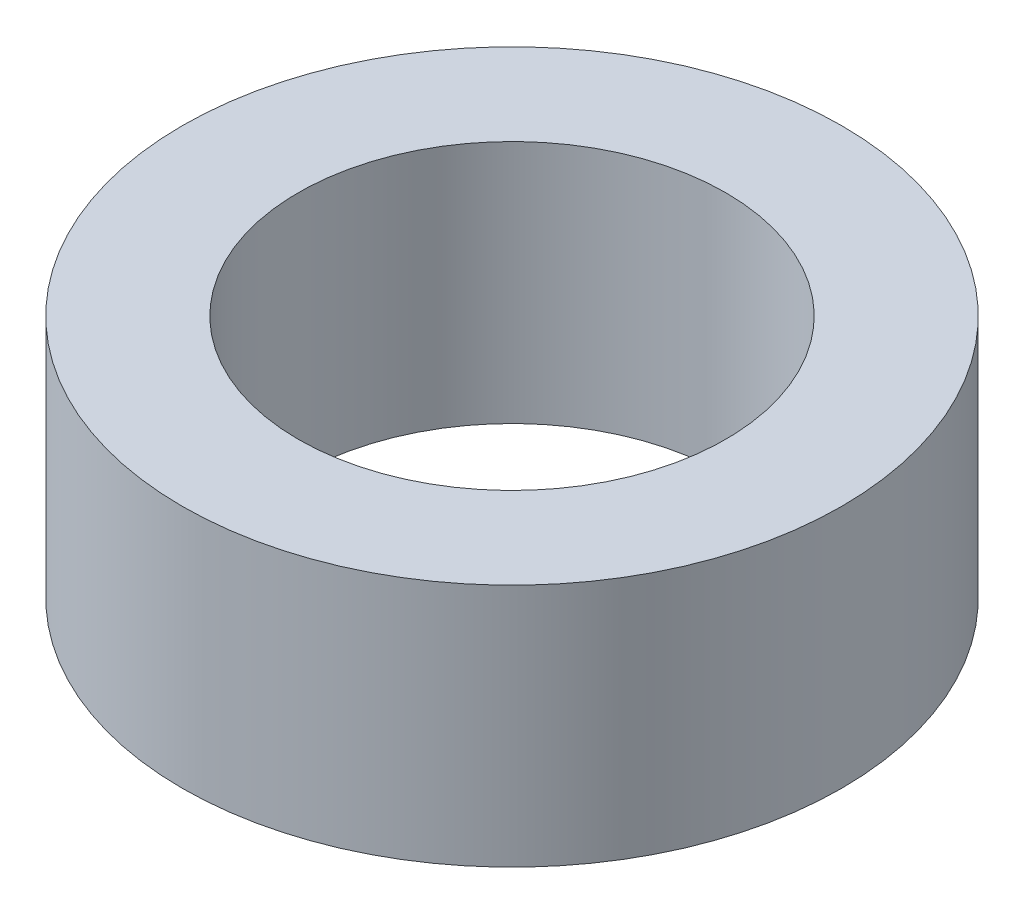
ISO-10303-21;
HEADER;
FILE_DESCRIPTION(('STEP AP214'),'2;1');
FILE_NAME('part.step','',(''),(''),'','','');
FILE_SCHEMA(('AUTOMOTIVE_DESIGN { 1 0 10303 214 1 1 1 1 }'));
ENDSEC;
DATA;
#1=APPLICATION_CONTEXT('core data for automotive mechanical design processes');
#2=APPLICATION_PROTOCOL_DEFINITION('international standard','automotive_design',2000,#1);
#3=PRODUCT_CONTEXT('',#1,'mechanical');
#4=PRODUCT('Part','Part','',(#3));
#5=PRODUCT_RELATED_PRODUCT_CATEGORY('part','',(#4));
#6=PRODUCT_DEFINITION_FORMATION('','',#4);
#7=PRODUCT_DEFINITION_CONTEXT('part definition',#1,'design');
#8=PRODUCT_DEFINITION('design','',#6,#7);
#9=PRODUCT_DEFINITION_SHAPE('','',#8);
#10=(LENGTH_UNIT() NAMED_UNIT(*) SI_UNIT(.MILLI.,.METRE.));
#11=(NAMED_UNIT(*) PLANE_ANGLE_UNIT() SI_UNIT($,.RADIAN.));
#12=(NAMED_UNIT(*) SI_UNIT($,.STERADIAN.) SOLID_ANGLE_UNIT());
#13=UNCERTAINTY_MEASURE_WITH_UNIT(LENGTH_MEASURE(1.E-05),#10,'distance_accuracy_value','');
#14=(GEOMETRIC_REPRESENTATION_CONTEXT(3) GLOBAL_UNCERTAINTY_ASSIGNED_CONTEXT((#13)) GLOBAL_UNIT_ASSIGNED_CONTEXT((#10,
#11,#12)) REPRESENTATION_CONTEXT('',''));
#15=CARTESIAN_POINT('',(0.,0.,0.));
#16=DIRECTION('',(0.,0.,1.));
#17=DIRECTION('',(1.,0.,0.));
#18=AXIS2_PLACEMENT_3D('',#15,#16,#17);
#19=CARTESIAN_POINT('',(0.,4.,0.));
#20=DIRECTION('',(0.,1.,0.));
#21=DIRECTION('',(0.,0.,1.));
#22=AXIS2_PLACEMENT_3D('',#19,#20,#21);
#23=PLANE('',#22);
#24=CARTESIAN_POINT('',(0.,4.,0.));
#25=DIRECTION('',(0.,1.,0.));
#26=DIRECTION('',(0.,0.,1.));
#27=AXIS2_PLACEMENT_3D('',#24,#25,#26);
#28=CIRCLE('',#27,5.4);
#29=CARTESIAN_POINT('',(0.,4.,5.4));
#30=VERTEX_POINT('',#29);
#31=EDGE_CURVE('E10',#30,#30,#28,.T.);
#32=ORIENTED_EDGE('',*,*,#31,.T.);
#33=EDGE_LOOP('',(#32));
#34=FACE_BOUND('',#33,.T.);
#35=CARTESIAN_POINT('',(0.,4.,0.));
#36=DIRECTION('',(0.,1.,0.));
#37=DIRECTION('',(0.,0.,1.));
#38=AXIS2_PLACEMENT_3D('',#35,#36,#37);
#39=CIRCLE('',#38,3.5);
#40=CARTESIAN_POINT('',(0.,4.,3.5));
#41=VERTEX_POINT('',#40);
#42=EDGE_CURVE('E56',#41,#41,#39,.T.);
#43=ORIENTED_EDGE('',*,*,#42,.F.);
#44=EDGE_LOOP('',(#43));
#45=FACE_BOUND('',#44,.T.);
#46=ADVANCED_FACE('F43',(#34,#45),#23,.T.);
#47=CARTESIAN_POINT('',(0.,0.,0.));
#48=DIRECTION('',(0.,1.,0.));
#49=DIRECTION('',(0.,0.,1.));
#50=AXIS2_PLACEMENT_3D('',#47,#48,#49);
#51=PLANE('',#50);
#52=CARTESIAN_POINT('',(0.,0.,0.));
#53=DIRECTION('',(0.,1.,0.));
#54=DIRECTION('',(0.,0.,1.));
#55=AXIS2_PLACEMENT_3D('',#52,#53,#54);
#56=CIRCLE('',#55,5.4);
#57=CARTESIAN_POINT('',(0.,0.,5.4));
#58=VERTEX_POINT('',#57);
#59=EDGE_CURVE('E47',#58,#58,#56,.T.);
#60=ORIENTED_EDGE('',*,*,#59,.F.);
#61=EDGE_LOOP('',(#60));
#62=FACE_BOUND('',#61,.T.);
#63=CARTESIAN_POINT('',(0.,0.,0.));
#64=DIRECTION('',(0.,1.,0.));
#65=DIRECTION('',(0.,0.,1.));
#66=AXIS2_PLACEMENT_3D('',#63,#64,#65);
#67=CIRCLE('',#66,3.5);
#68=CARTESIAN_POINT('',(0.,0.,3.5));
#69=VERTEX_POINT('',#68);
#70=EDGE_CURVE('E58',#69,#69,#67,.T.);
#71=ORIENTED_EDGE('',*,*,#70,.T.);
#72=EDGE_LOOP('',(#71));
#73=FACE_BOUND('',#72,.T.);
#74=ADVANCED_FACE('F70',(#62,#73),#51,.F.);
#75=CARTESIAN_POINT('',(0.,4.,0.));
#76=DIRECTION('',(0.,-1.,0.));
#77=DIRECTION('',(0.,0.,-1.));
#78=AXIS2_PLACEMENT_3D('',#75,#76,#77);
#79=CYLINDRICAL_SURFACE('',#78,5.4);
#80=ORIENTED_EDGE('',*,*,#31,.F.);
#81=EDGE_LOOP('',(#80));
#82=FACE_BOUND('',#81,.T.);
#83=ORIENTED_EDGE('',*,*,#59,.T.);
#84=EDGE_LOOP('',(#83));
#85=FACE_BOUND('',#84,.T.);
#86=ADVANCED_FACE('F45',(#82,#85),#79,.T.);
#87=CARTESIAN_POINT('',(0.,4.,0.));
#88=DIRECTION('',(0.,-1.,0.));
#89=DIRECTION('',(0.,0.,-1.));
#90=AXIS2_PLACEMENT_3D('',#87,#88,#89);
#91=CYLINDRICAL_SURFACE('',#90,3.5);
#92=ORIENTED_EDGE('',*,*,#42,.T.);
#93=EDGE_LOOP('',(#92));
#94=FACE_BOUND('',#93,.T.);
#95=ORIENTED_EDGE('',*,*,#70,.F.);
#96=EDGE_LOOP('',(#95));
#97=FACE_BOUND('',#96,.T.);
#98=ADVANCED_FACE('F66',(#94,#97),#91,.F.);
#99=CLOSED_SHELL('',(#46,#74,#86,#98));
#100=MANIFOLD_SOLID_BREP('B2',#99);
#101=ADVANCED_BREP_SHAPE_REPRESENTATION('',(#18,#100),#14);
#102=SHAPE_DEFINITION_REPRESENTATION(#9,#101);
ENDSEC;
END-ISO-10303-21;
